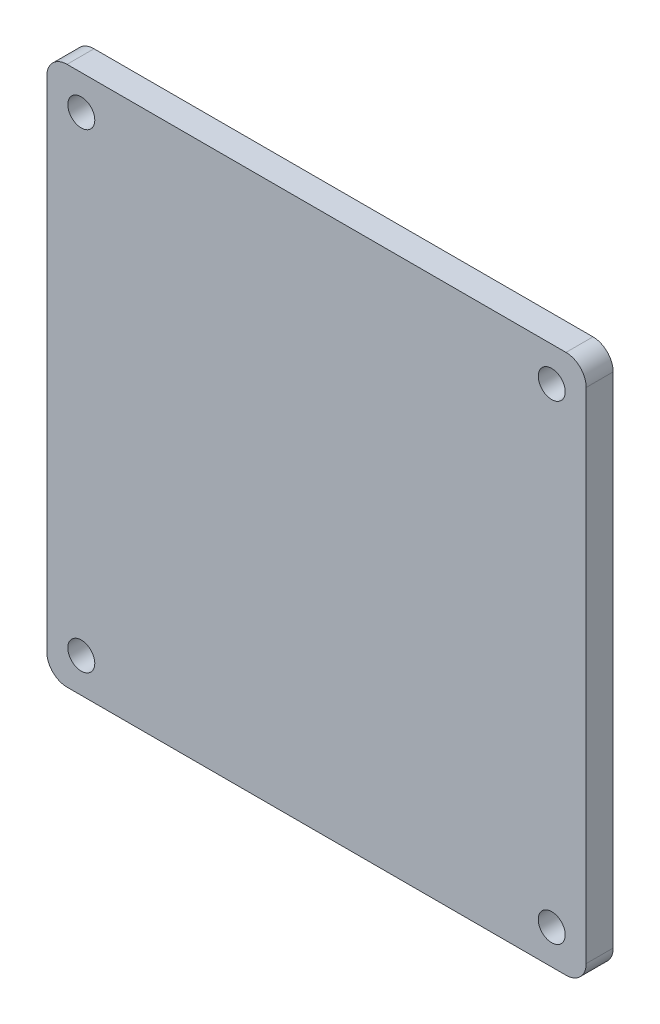
ISO-10303-21;
HEADER;
FILE_DESCRIPTION(('STEP AP214'),'2;1');
FILE_NAME('part.step','',(''),(''),'','','');
FILE_SCHEMA(('AUTOMOTIVE_DESIGN { 1 0 10303 214 1 1 1 1 }'));
ENDSEC;
DATA;
#1=APPLICATION_CONTEXT('core data for automotive mechanical design processes');
#2=APPLICATION_PROTOCOL_DEFINITION('international standard','automotive_design',2000,#1);
#3=PRODUCT_CONTEXT('',#1,'mechanical');
#4=PRODUCT('Part','Part','',(#3));
#5=PRODUCT_RELATED_PRODUCT_CATEGORY('part','',(#4));
#6=PRODUCT_DEFINITION_FORMATION('','',#4);
#7=PRODUCT_DEFINITION_CONTEXT('part definition',#1,'design');
#8=PRODUCT_DEFINITION('design','',#6,#7);
#9=PRODUCT_DEFINITION_SHAPE('','',#8);
#10=(LENGTH_UNIT() NAMED_UNIT(*) SI_UNIT(.MILLI.,.METRE.));
#11=(NAMED_UNIT(*) PLANE_ANGLE_UNIT() SI_UNIT($,.RADIAN.));
#12=(NAMED_UNIT(*) SI_UNIT($,.STERADIAN.) SOLID_ANGLE_UNIT());
#13=UNCERTAINTY_MEASURE_WITH_UNIT(LENGTH_MEASURE(1.E-05),#10,'distance_accuracy_value','');
#14=(GEOMETRIC_REPRESENTATION_CONTEXT(3) GLOBAL_UNCERTAINTY_ASSIGNED_CONTEXT((#13)) GLOBAL_UNIT_ASSIGNED_CONTEXT((#10,
#11,#12)) REPRESENTATION_CONTEXT('',''));
#15=CARTESIAN_POINT('',(0.,0.,0.));
#16=DIRECTION('',(0.,0.,1.));
#17=DIRECTION('',(1.,0.,0.));
#18=AXIS2_PLACEMENT_3D('',#15,#16,#17);
#19=CARTESIAN_POINT('',(-18.5,-18.5,2.));
#20=DIRECTION('',(0.,0.,-1.));
#21=DIRECTION('',(-1.,0.,0.));
#22=AXIS2_PLACEMENT_3D('',#19,#20,#21);
#23=PLANE('',#22);
#24=CARTESIAN_POINT('',(-18.5,-18.5,2.));
#25=DIRECTION('',(0.,0.,1.));
#26=DIRECTION('',(-1.,0.,0.));
#27=AXIS2_PLACEMENT_3D('',#24,#25,#26);
#28=CIRCLE('',#27,1.5);
#29=CARTESIAN_POINT('',(-20.,-18.5,2.));
#30=VERTEX_POINT('',#29);
#31=CARTESIAN_POINT('',(-18.5,-20.,2.));
#32=VERTEX_POINT('',#31);
#33=EDGE_CURVE('E145',#30,#32,#28,.T.);
#34=ORIENTED_EDGE('',*,*,#33,.T.);
#35=DIRECTION('',(1.,0.,0.));
#36=VECTOR('',#35,1.);
#37=CARTESIAN_POINT('',(-18.5,-20.,2.));
#38=LINE('',#37,#36);
#39=CARTESIAN_POINT('',(18.5,-20.,2.));
#40=VERTEX_POINT('',#39);
#41=EDGE_CURVE('E93',#32,#40,#38,.T.);
#42=ORIENTED_EDGE('',*,*,#41,.T.);
#43=CARTESIAN_POINT('',(18.5,-18.5,2.));
#44=DIRECTION('',(0.,0.,1.));
#45=DIRECTION('',(1.,0.,0.));
#46=AXIS2_PLACEMENT_3D('',#43,#44,#45);
#47=CIRCLE('',#46,1.5);
#48=CARTESIAN_POINT('',(20.,-18.5,2.));
#49=VERTEX_POINT('',#48);
#50=EDGE_CURVE('E160',#40,#49,#47,.T.);
#51=ORIENTED_EDGE('',*,*,#50,.T.);
#52=DIRECTION('',(0.,1.,0.));
#53=VECTOR('',#52,1.);
#54=CARTESIAN_POINT('',(20.,-18.5,2.));
#55=LINE('',#54,#53);
#56=CARTESIAN_POINT('',(20.,18.5,2.));
#57=VERTEX_POINT('',#56);
#58=EDGE_CURVE('E173',#49,#57,#55,.T.);
#59=ORIENTED_EDGE('',*,*,#58,.T.);
#60=CARTESIAN_POINT('',(18.5,18.5,2.));
#61=DIRECTION('',(0.,0.,1.));
#62=DIRECTION('',(1.,0.,0.));
#63=AXIS2_PLACEMENT_3D('',#60,#61,#62);
#64=CIRCLE('',#63,1.5);
#65=CARTESIAN_POINT('',(18.5,20.,2.));
#66=VERTEX_POINT('',#65);
#67=EDGE_CURVE('E112',#57,#66,#64,.T.);
#68=ORIENTED_EDGE('',*,*,#67,.T.);
#69=DIRECTION('',(-1.,0.,0.));
#70=VECTOR('',#69,1.);
#71=CARTESIAN_POINT('',(-18.5,20.,2.));
#72=LINE('',#71,#70);
#73=CARTESIAN_POINT('',(-18.5,20.,2.));
#74=VERTEX_POINT('',#73);
#75=EDGE_CURVE('E106',#66,#74,#72,.T.);
#76=ORIENTED_EDGE('',*,*,#75,.T.);
#77=CARTESIAN_POINT('',(-18.5,18.5,2.));
#78=DIRECTION('',(0.,0.,1.));
#79=DIRECTION('',(-1.,0.,0.));
#80=AXIS2_PLACEMENT_3D('',#77,#78,#79);
#81=CIRCLE('',#80,1.5);
#82=CARTESIAN_POINT('',(-20.,18.5,2.));
#83=VERTEX_POINT('',#82);
#84=EDGE_CURVE('E110',#74,#83,#81,.T.);
#85=ORIENTED_EDGE('',*,*,#84,.T.);
#86=DIRECTION('',(0.,-1.,0.));
#87=VECTOR('',#86,1.);
#88=CARTESIAN_POINT('',(-20.,-18.5,2.));
#89=LINE('',#88,#87);
#90=EDGE_CURVE('E50',#83,#30,#89,.T.);
#91=ORIENTED_EDGE('',*,*,#90,.T.);
#92=EDGE_LOOP('',(#34,#42,#51,#59,#68,#76,#85,#91));
#93=FACE_BOUND('',#92,.T.);
#94=CARTESIAN_POINT('',(-17.4424312761678,17.4424312761678,2.));
#95=DIRECTION('',(0.,0.,1.));
#96=DIRECTION('',(1.,0.,0.));
#97=AXIS2_PLACEMENT_3D('',#94,#95,#96);
#98=CIRCLE('',#97,1.);
#99=CARTESIAN_POINT('',(-16.4424312761678,17.4424312761678,2.));
#100=VERTEX_POINT('',#99);
#101=EDGE_CURVE('E134',#100,#100,#98,.T.);
#102=ORIENTED_EDGE('',*,*,#101,.F.);
#103=EDGE_LOOP('',(#102));
#104=FACE_BOUND('',#103,.T.);
#105=CARTESIAN_POINT('',(17.4424312761678,17.4424312761688,2.));
#106=DIRECTION('',(0.,0.,1.));
#107=DIRECTION('',(1.,0.,0.));
#108=AXIS2_PLACEMENT_3D('',#105,#106,#107);
#109=CIRCLE('',#108,1.);
#110=CARTESIAN_POINT('',(18.4424312761678,17.4424312761688,2.));
#111=VERTEX_POINT('',#110);
#112=EDGE_CURVE('E182',#111,#111,#109,.T.);
#113=ORIENTED_EDGE('',*,*,#112,.F.);
#114=EDGE_LOOP('',(#113));
#115=FACE_BOUND('',#114,.T.);
#116=CARTESIAN_POINT('',(17.4424312761688,-17.4424312761668,2.));
#117=DIRECTION('',(0.,0.,1.));
#118=DIRECTION('',(1.,0.,0.));
#119=AXIS2_PLACEMENT_3D('',#116,#117,#118);
#120=CIRCLE('',#119,1.);
#121=CARTESIAN_POINT('',(18.4424312761688,-17.4424312761668,2.));
#122=VERTEX_POINT('',#121);
#123=EDGE_CURVE('E188',#122,#122,#120,.T.);
#124=ORIENTED_EDGE('',*,*,#123,.F.);
#125=EDGE_LOOP('',(#124));
#126=FACE_BOUND('',#125,.T.);
#127=CARTESIAN_POINT('',(-17.4424312761668,-17.4424312761678,2.));
#128=DIRECTION('',(0.,0.,1.));
#129=DIRECTION('',(1.,0.,0.));
#130=AXIS2_PLACEMENT_3D('',#127,#128,#129);
#131=CIRCLE('',#130,1.);
#132=CARTESIAN_POINT('',(-16.4424312761668,-17.4424312761678,2.));
#133=VERTEX_POINT('',#132);
#134=EDGE_CURVE('E194',#133,#133,#131,.T.);
#135=ORIENTED_EDGE('',*,*,#134,.F.);
#136=EDGE_LOOP('',(#135));
#137=FACE_BOUND('',#136,.T.);
#138=ADVANCED_FACE('F33',(#93,#104,#115,#126,#137),#23,.F.);
#139=CARTESIAN_POINT('',(-18.5,-18.5,0.));
#140=DIRECTION('',(0.,0.,-1.));
#141=DIRECTION('',(-1.,0.,0.));
#142=AXIS2_PLACEMENT_3D('',#139,#140,#141);
#143=PLANE('',#142);
#144=CARTESIAN_POINT('',(17.4424312761688,-17.4424312761668,0.));
#145=DIRECTION('',(0.,0.,1.));
#146=DIRECTION('',(1.,0.,0.));
#147=AXIS2_PLACEMENT_3D('',#144,#145,#146);
#148=CIRCLE('',#147,1.);
#149=CARTESIAN_POINT('',(18.4424312761688,-17.4424312761668,0.));
#150=VERTEX_POINT('',#149);
#151=EDGE_CURVE('E191',#150,#150,#148,.T.);
#152=ORIENTED_EDGE('',*,*,#151,.T.);
#153=EDGE_LOOP('',(#152));
#154=FACE_BOUND('',#153,.T.);
#155=CARTESIAN_POINT('',(-17.4424312761678,17.4424312761678,0.));
#156=DIRECTION('',(0.,0.,1.));
#157=DIRECTION('',(1.,0.,0.));
#158=AXIS2_PLACEMENT_3D('',#155,#156,#157);
#159=CIRCLE('',#158,1.);
#160=CARTESIAN_POINT('',(-16.4424312761678,17.4424312761678,0.));
#161=VERTEX_POINT('',#160);
#162=EDGE_CURVE('E179',#161,#161,#159,.T.);
#163=ORIENTED_EDGE('',*,*,#162,.T.);
#164=EDGE_LOOP('',(#163));
#165=FACE_BOUND('',#164,.T.);
#166=CARTESIAN_POINT('',(-18.5,-18.5,0.));
#167=DIRECTION('',(0.,0.,1.));
#168=DIRECTION('',(-1.,0.,0.));
#169=AXIS2_PLACEMENT_3D('',#166,#167,#168);
#170=CIRCLE('',#169,1.5);
#171=CARTESIAN_POINT('',(-20.,-18.5,0.));
#172=VERTEX_POINT('',#171);
#173=CARTESIAN_POINT('',(-18.5,-20.,0.));
#174=VERTEX_POINT('',#173);
#175=EDGE_CURVE('E130',#172,#174,#170,.T.);
#176=ORIENTED_EDGE('',*,*,#175,.F.);
#177=DIRECTION('',(0.,-1.,0.));
#178=VECTOR('',#177,1.);
#179=CARTESIAN_POINT('',(-20.,-18.5,0.));
#180=LINE('',#179,#178);
#181=CARTESIAN_POINT('',(-20.,18.5,0.));
#182=VERTEX_POINT('',#181);
#183=EDGE_CURVE('E85',#182,#172,#180,.T.);
#184=ORIENTED_EDGE('',*,*,#183,.F.);
#185=CARTESIAN_POINT('',(-18.5,18.5,0.));
#186=DIRECTION('',(0.,0.,1.));
#187=DIRECTION('',(-1.,0.,0.));
#188=AXIS2_PLACEMENT_3D('',#185,#186,#187);
#189=CIRCLE('',#188,1.5);
#190=CARTESIAN_POINT('',(-18.5,20.,0.));
#191=VERTEX_POINT('',#190);
#192=EDGE_CURVE('E79',#191,#182,#189,.T.);
#193=ORIENTED_EDGE('',*,*,#192,.F.);
#194=DIRECTION('',(-1.,0.,0.));
#195=VECTOR('',#194,1.);
#196=CARTESIAN_POINT('',(-18.5,20.,0.));
#197=LINE('',#196,#195);
#198=CARTESIAN_POINT('',(18.5,20.,0.));
#199=VERTEX_POINT('',#198);
#200=EDGE_CURVE('E120',#199,#191,#197,.T.);
#201=ORIENTED_EDGE('',*,*,#200,.F.);
#202=CARTESIAN_POINT('',(18.5,18.5,0.));
#203=DIRECTION('',(0.,0.,1.));
#204=DIRECTION('',(1.,0.,0.));
#205=AXIS2_PLACEMENT_3D('',#202,#203,#204);
#206=CIRCLE('',#205,1.5);
#207=CARTESIAN_POINT('',(20.,18.5,0.));
#208=VERTEX_POINT('',#207);
#209=EDGE_CURVE('E140',#208,#199,#206,.T.);
#210=ORIENTED_EDGE('',*,*,#209,.F.);
#211=DIRECTION('',(0.,1.,0.));
#212=VECTOR('',#211,1.);
#213=CARTESIAN_POINT('',(20.,-18.5,0.));
#214=LINE('',#213,#212);
#215=CARTESIAN_POINT('',(20.,-18.5,0.));
#216=VERTEX_POINT('',#215);
#217=EDGE_CURVE('E138',#216,#208,#214,.T.);
#218=ORIENTED_EDGE('',*,*,#217,.F.);
#219=CARTESIAN_POINT('',(18.5,-18.5,0.));
#220=DIRECTION('',(0.,0.,1.));
#221=DIRECTION('',(1.,0.,0.));
#222=AXIS2_PLACEMENT_3D('',#219,#220,#221);
#223=CIRCLE('',#222,1.5);
#224=CARTESIAN_POINT('',(18.5,-20.,0.));
#225=VERTEX_POINT('',#224);
#226=EDGE_CURVE('E136',#225,#216,#223,.T.);
#227=ORIENTED_EDGE('',*,*,#226,.F.);
#228=DIRECTION('',(1.,0.,0.));
#229=VECTOR('',#228,1.);
#230=CARTESIAN_POINT('',(-18.5,-20.,0.));
#231=LINE('',#230,#229);
#232=EDGE_CURVE('E133',#174,#225,#231,.T.);
#233=ORIENTED_EDGE('',*,*,#232,.F.);
#234=EDGE_LOOP('',(#176,#184,#193,#201,#210,#218,#227,#233));
#235=FACE_BOUND('',#234,.T.);
#236=CARTESIAN_POINT('',(17.4424312761678,17.4424312761688,0.));
#237=DIRECTION('',(0.,0.,1.));
#238=DIRECTION('',(1.,0.,0.));
#239=AXIS2_PLACEMENT_3D('',#236,#237,#238);
#240=CIRCLE('',#239,1.);
#241=CARTESIAN_POINT('',(18.4424312761678,17.4424312761688,0.));
#242=VERTEX_POINT('',#241);
#243=EDGE_CURVE('E185',#242,#242,#240,.T.);
#244=ORIENTED_EDGE('',*,*,#243,.T.);
#245=EDGE_LOOP('',(#244));
#246=FACE_BOUND('',#245,.T.);
#247=CARTESIAN_POINT('',(-17.4424312761668,-17.4424312761678,0.));
#248=DIRECTION('',(0.,0.,1.));
#249=DIRECTION('',(1.,0.,0.));
#250=AXIS2_PLACEMENT_3D('',#247,#248,#249);
#251=CIRCLE('',#250,1.);
#252=CARTESIAN_POINT('',(-16.4424312761668,-17.4424312761678,0.));
#253=VERTEX_POINT('',#252);
#254=EDGE_CURVE('E197',#253,#253,#251,.T.);
#255=ORIENTED_EDGE('',*,*,#254,.T.);
#256=EDGE_LOOP('',(#255));
#257=FACE_BOUND('',#256,.T.);
#258=ADVANCED_FACE('F164',(#154,#165,#235,#246,#257),#143,.T.);
#259=CARTESIAN_POINT('',(-18.5,-18.5,2.));
#260=DIRECTION('',(0.,0.,-1.));
#261=DIRECTION('',(-1.,0.,0.));
#262=AXIS2_PLACEMENT_3D('',#259,#260,#261);
#263=CYLINDRICAL_SURFACE('',#262,1.5);
#264=ORIENTED_EDGE('',*,*,#175,.T.);
#265=DIRECTION('',(0.,0.,-1.));
#266=VECTOR('',#265,1.);
#267=CARTESIAN_POINT('',(-18.5,-20.,2.));
#268=LINE('',#267,#266);
#269=EDGE_CURVE('E11',#32,#174,#268,.T.);
#270=ORIENTED_EDGE('',*,*,#269,.F.);
#271=ORIENTED_EDGE('',*,*,#33,.F.);
#272=DIRECTION('',(0.,0.,-1.));
#273=VECTOR('',#272,1.);
#274=CARTESIAN_POINT('',(-20.,-18.5,2.));
#275=LINE('',#274,#273);
#276=EDGE_CURVE('E126',#30,#172,#275,.T.);
#277=ORIENTED_EDGE('',*,*,#276,.T.);
#278=EDGE_LOOP('',(#264,#270,#271,#277));
#279=FACE_BOUND('',#278,.T.);
#280=ADVANCED_FACE('F35',(#279),#263,.T.);
#281=CARTESIAN_POINT('',(-18.5,-20.,2.));
#282=DIRECTION('',(0.,1.,0.));
#283=DIRECTION('',(0.,0.,1.));
#284=AXIS2_PLACEMENT_3D('',#281,#282,#283);
#285=PLANE('',#284);
#286=ORIENTED_EDGE('',*,*,#232,.T.);
#287=DIRECTION('',(0.,0.,-1.));
#288=VECTOR('',#287,1.);
#289=CARTESIAN_POINT('',(18.5,-20.,2.));
#290=LINE('',#289,#288);
#291=EDGE_CURVE('E42',#40,#225,#290,.T.);
#292=ORIENTED_EDGE('',*,*,#291,.F.);
#293=ORIENTED_EDGE('',*,*,#41,.F.);
#294=ORIENTED_EDGE('',*,*,#269,.T.);
#295=EDGE_LOOP('',(#286,#292,#293,#294));
#296=FACE_BOUND('',#295,.T.);
#297=ADVANCED_FACE('F229',(#296),#285,.F.);
#298=CARTESIAN_POINT('',(18.5,-18.5,2.));
#299=DIRECTION('',(0.,0.,-1.));
#300=DIRECTION('',(-1.,0.,0.));
#301=AXIS2_PLACEMENT_3D('',#298,#299,#300);
#302=CYLINDRICAL_SURFACE('',#301,1.5);
#303=ORIENTED_EDGE('',*,*,#226,.T.);
#304=DIRECTION('',(0.,0.,-1.));
#305=VECTOR('',#304,1.);
#306=CARTESIAN_POINT('',(20.,-18.5,2.));
#307=LINE('',#306,#305);
#308=EDGE_CURVE('E152',#49,#216,#307,.T.);
#309=ORIENTED_EDGE('',*,*,#308,.F.);
#310=ORIENTED_EDGE('',*,*,#50,.F.);
#311=ORIENTED_EDGE('',*,*,#291,.T.);
#312=EDGE_LOOP('',(#303,#309,#310,#311));
#313=FACE_BOUND('',#312,.T.);
#314=ADVANCED_FACE('F158',(#313),#302,.T.);
#315=CARTESIAN_POINT('',(20.,-18.5,2.));
#316=DIRECTION('',(-1.,0.,0.));
#317=DIRECTION('',(0.,0.,1.));
#318=AXIS2_PLACEMENT_3D('',#315,#316,#317);
#319=PLANE('',#318);
#320=ORIENTED_EDGE('',*,*,#217,.T.);
#321=DIRECTION('',(0.,0.,-1.));
#322=VECTOR('',#321,1.);
#323=CARTESIAN_POINT('',(20.,18.5,2.));
#324=LINE('',#323,#322);
#325=EDGE_CURVE('E149',#57,#208,#324,.T.);
#326=ORIENTED_EDGE('',*,*,#325,.F.);
#327=ORIENTED_EDGE('',*,*,#58,.F.);
#328=ORIENTED_EDGE('',*,*,#308,.T.);
#329=EDGE_LOOP('',(#320,#326,#327,#328));
#330=FACE_BOUND('',#329,.T.);
#331=ADVANCED_FACE('F169',(#330),#319,.F.);
#332=CARTESIAN_POINT('',(18.5,18.5,2.));
#333=DIRECTION('',(0.,0.,-1.));
#334=DIRECTION('',(-1.,0.,0.));
#335=AXIS2_PLACEMENT_3D('',#332,#333,#334);
#336=CYLINDRICAL_SURFACE('',#335,1.5);
#337=ORIENTED_EDGE('',*,*,#209,.T.);
#338=DIRECTION('',(0.,0.,-1.));
#339=VECTOR('',#338,1.);
#340=CARTESIAN_POINT('',(18.5,20.,2.));
#341=LINE('',#340,#339);
#342=EDGE_CURVE('E121',#66,#199,#341,.T.);
#343=ORIENTED_EDGE('',*,*,#342,.F.);
#344=ORIENTED_EDGE('',*,*,#67,.F.);
#345=ORIENTED_EDGE('',*,*,#325,.T.);
#346=EDGE_LOOP('',(#337,#343,#344,#345));
#347=FACE_BOUND('',#346,.T.);
#348=ADVANCED_FACE('F172',(#347),#336,.T.);
#349=CARTESIAN_POINT('',(-18.5,20.,2.));
#350=DIRECTION('',(0.,-1.,0.));
#351=DIRECTION('',(0.,0.,-1.));
#352=AXIS2_PLACEMENT_3D('',#349,#350,#351);
#353=PLANE('',#352);
#354=ORIENTED_EDGE('',*,*,#200,.T.);
#355=DIRECTION('',(0.,0.,-1.));
#356=VECTOR('',#355,1.);
#357=CARTESIAN_POINT('',(-18.5,20.,2.));
#358=LINE('',#357,#356);
#359=EDGE_CURVE('E117',#74,#191,#358,.T.);
#360=ORIENTED_EDGE('',*,*,#359,.F.);
#361=ORIENTED_EDGE('',*,*,#75,.F.);
#362=ORIENTED_EDGE('',*,*,#342,.T.);
#363=EDGE_LOOP('',(#354,#360,#361,#362));
#364=FACE_BOUND('',#363,.T.);
#365=ADVANCED_FACE('F118',(#364),#353,.F.);
#366=CARTESIAN_POINT('',(-18.5,18.5,2.));
#367=DIRECTION('',(0.,0.,-1.));
#368=DIRECTION('',(-1.,0.,0.));
#369=AXIS2_PLACEMENT_3D('',#366,#367,#368);
#370=CYLINDRICAL_SURFACE('',#369,1.5);
#371=ORIENTED_EDGE('',*,*,#192,.T.);
#372=DIRECTION('',(0.,0.,-1.));
#373=VECTOR('',#372,1.);
#374=CARTESIAN_POINT('',(-20.,18.5,2.));
#375=LINE('',#374,#373);
#376=EDGE_CURVE('E122',#83,#182,#375,.T.);
#377=ORIENTED_EDGE('',*,*,#376,.F.);
#378=ORIENTED_EDGE('',*,*,#84,.F.);
#379=ORIENTED_EDGE('',*,*,#359,.T.);
#380=EDGE_LOOP('',(#371,#377,#378,#379));
#381=FACE_BOUND('',#380,.T.);
#382=ADVANCED_FACE('F124',(#381),#370,.T.);
#383=CARTESIAN_POINT('',(-20.,-18.5,2.));
#384=DIRECTION('',(1.,0.,0.));
#385=DIRECTION('',(0.,0.,-1.));
#386=AXIS2_PLACEMENT_3D('',#383,#384,#385);
#387=PLANE('',#386);
#388=ORIENTED_EDGE('',*,*,#183,.T.);
#389=ORIENTED_EDGE('',*,*,#276,.F.);
#390=ORIENTED_EDGE('',*,*,#90,.F.);
#391=ORIENTED_EDGE('',*,*,#376,.T.);
#392=EDGE_LOOP('',(#388,#389,#390,#391));
#393=FACE_BOUND('',#392,.T.);
#394=ADVANCED_FACE('F217',(#393),#387,.F.);
#395=CARTESIAN_POINT('',(-17.4424312761678,17.4424312761678,2.));
#396=DIRECTION('',(0.,0.,-1.));
#397=DIRECTION('',(-1.,0.,0.));
#398=AXIS2_PLACEMENT_3D('',#395,#396,#397);
#399=CYLINDRICAL_SURFACE('',#398,1.);
#400=ORIENTED_EDGE('',*,*,#101,.T.);
#401=EDGE_LOOP('',(#400));
#402=FACE_BOUND('',#401,.T.);
#403=ORIENTED_EDGE('',*,*,#162,.F.);
#404=EDGE_LOOP('',(#403));
#405=FACE_BOUND('',#404,.T.);
#406=ADVANCED_FACE('F214',(#402,#405),#399,.F.);
#407=CARTESIAN_POINT('',(17.4424312761678,17.4424312761688,2.));
#408=DIRECTION('',(0.,0.,-1.));
#409=DIRECTION('',(-1.,0.,0.));
#410=AXIS2_PLACEMENT_3D('',#407,#408,#409);
#411=CYLINDRICAL_SURFACE('',#410,1.);
#412=ORIENTED_EDGE('',*,*,#112,.T.);
#413=EDGE_LOOP('',(#412));
#414=FACE_BOUND('',#413,.T.);
#415=ORIENTED_EDGE('',*,*,#243,.F.);
#416=EDGE_LOOP('',(#415));
#417=FACE_BOUND('',#416,.T.);
#418=ADVANCED_FACE('F293',(#414,#417),#411,.F.);
#419=CARTESIAN_POINT('',(17.4424312761688,-17.4424312761668,2.));
#420=DIRECTION('',(0.,0.,-1.));
#421=DIRECTION('',(-1.,0.,0.));
#422=AXIS2_PLACEMENT_3D('',#419,#420,#421);
#423=CYLINDRICAL_SURFACE('',#422,1.);
#424=ORIENTED_EDGE('',*,*,#123,.T.);
#425=EDGE_LOOP('',(#424));
#426=FACE_BOUND('',#425,.T.);
#427=ORIENTED_EDGE('',*,*,#151,.F.);
#428=EDGE_LOOP('',(#427));
#429=FACE_BOUND('',#428,.T.);
#430=ADVANCED_FACE('F301',(#426,#429),#423,.F.);
#431=CARTESIAN_POINT('',(-17.4424312761668,-17.4424312761678,2.));
#432=DIRECTION('',(0.,0.,-1.));
#433=DIRECTION('',(-1.,0.,0.));
#434=AXIS2_PLACEMENT_3D('',#431,#432,#433);
#435=CYLINDRICAL_SURFACE('',#434,1.);
#436=ORIENTED_EDGE('',*,*,#134,.T.);
#437=EDGE_LOOP('',(#436));
#438=FACE_BOUND('',#437,.T.);
#439=ORIENTED_EDGE('',*,*,#254,.F.);
#440=EDGE_LOOP('',(#439));
#441=FACE_BOUND('',#440,.T.);
#442=ADVANCED_FACE('F203',(#438,#441),#435,.F.);
#443=CLOSED_SHELL('',(#138,#258,#280,#297,#314,#331,#348,#365,#382,#394,#406,#418,#430,#442));
#444=MANIFOLD_SOLID_BREP('B2',#443);
#445=ADVANCED_BREP_SHAPE_REPRESENTATION('',(#18,#444),#14);
#446=SHAPE_DEFINITION_REPRESENTATION(#9,#445);
ENDSEC;
END-ISO-10303-21;
